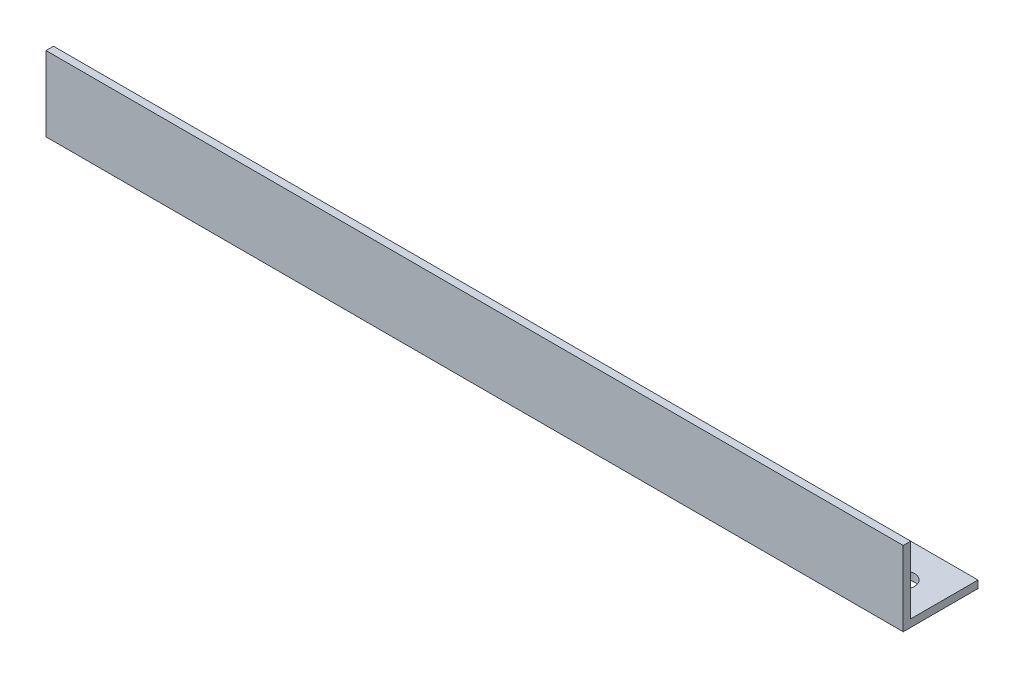
ISO-10303-21;
HEADER;
FILE_DESCRIPTION(('STEP AP214'),'2;1');
FILE_NAME('part.step','',(''),(''),'','','');
FILE_SCHEMA(('AUTOMOTIVE_DESIGN { 1 0 10303 214 1 1 1 1 }'));
ENDSEC;
DATA;
#1=APPLICATION_CONTEXT('core data for automotive mechanical design processes');
#2=APPLICATION_PROTOCOL_DEFINITION('international standard','automotive_design',2000,#1);
#3=PRODUCT_CONTEXT('',#1,'mechanical');
#4=PRODUCT('Part','Part','',(#3));
#5=PRODUCT_RELATED_PRODUCT_CATEGORY('part','',(#4));
#6=PRODUCT_DEFINITION_FORMATION('','',#4);
#7=PRODUCT_DEFINITION_CONTEXT('part definition',#1,'design');
#8=PRODUCT_DEFINITION('design','',#6,#7);
#9=PRODUCT_DEFINITION_SHAPE('','',#8);
#10=(LENGTH_UNIT() NAMED_UNIT(*) SI_UNIT(.MILLI.,.METRE.));
#11=(NAMED_UNIT(*) PLANE_ANGLE_UNIT() SI_UNIT($,.RADIAN.));
#12=(NAMED_UNIT(*) SI_UNIT($,.STERADIAN.) SOLID_ANGLE_UNIT());
#13=UNCERTAINTY_MEASURE_WITH_UNIT(LENGTH_MEASURE(1.E-05),#10,'distance_accuracy_value','');
#14=(GEOMETRIC_REPRESENTATION_CONTEXT(3) GLOBAL_UNCERTAINTY_ASSIGNED_CONTEXT((#13)) GLOBAL_UNIT_ASSIGNED_CONTEXT((#10,
#11,#12)) REPRESENTATION_CONTEXT('',''));
#15=CARTESIAN_POINT('',(0.,0.,0.));
#16=DIRECTION('',(0.,0.,1.));
#17=DIRECTION('',(1.,0.,0.));
#18=AXIS2_PLACEMENT_3D('',#15,#16,#17);
#19=CARTESIAN_POINT('',(172.,0.,-15.));
#20=DIRECTION('',(0.,1.,0.));
#21=DIRECTION('',(0.,0.,1.));
#22=AXIS2_PLACEMENT_3D('',#19,#20,#21);
#23=PLANE('',#22);
#24=CARTESIAN_POINT('',(7.5,0.,-7.49999999999999));
#25=DIRECTION('',(0.,-1.,0.));
#26=DIRECTION('',(0.,0.,-1.));
#27=AXIS2_PLACEMENT_3D('',#24,#25,#26);
#28=CIRCLE('',#27,2.25);
#29=CARTESIAN_POINT('',(7.5,0.,-9.74999999999999));
#30=VERTEX_POINT('',#29);
#31=EDGE_CURVE('E140',#30,#30,#28,.T.);
#32=ORIENTED_EDGE('',*,*,#31,.F.);
#33=EDGE_LOOP('',(#32));
#34=FACE_BOUND('',#33,.T.);
#35=CARTESIAN_POINT('',(164.5,0.,-7.49999999999999));
#36=DIRECTION('',(0.,-1.,0.));
#37=DIRECTION('',(0.,0.,-1.));
#38=AXIS2_PLACEMENT_3D('',#35,#36,#37);
#39=CIRCLE('',#38,2.25000000000001);
#40=CARTESIAN_POINT('',(164.5,0.,-9.75));
#41=VERTEX_POINT('',#40);
#42=EDGE_CURVE('E145',#41,#41,#39,.T.);
#43=ORIENTED_EDGE('',*,*,#42,.F.);
#44=EDGE_LOOP('',(#43));
#45=FACE_BOUND('',#44,.T.);
#46=DIRECTION('',(0.,0.,-1.));
#47=VECTOR('',#46,1.);
#48=CARTESIAN_POINT('',(0.,0.,-15.));
#49=LINE('',#48,#47);
#50=CARTESIAN_POINT('',(0.,0.,0.));
#51=VERTEX_POINT('',#50);
#52=CARTESIAN_POINT('',(0.,0.,-15.));
#53=VERTEX_POINT('',#52);
#54=EDGE_CURVE('E123',#51,#53,#49,.T.);
#55=ORIENTED_EDGE('',*,*,#54,.T.);
#56=DIRECTION('',(-1.,0.,0.));
#57=VECTOR('',#56,1.);
#58=CARTESIAN_POINT('',(172.,0.,-15.));
#59=LINE('',#58,#57);
#60=CARTESIAN_POINT('',(172.,0.,-15.));
#61=VERTEX_POINT('',#60);
#62=EDGE_CURVE('E11',#61,#53,#59,.T.);
#63=ORIENTED_EDGE('',*,*,#62,.F.);
#64=DIRECTION('',(0.,0.,-1.));
#65=VECTOR('',#64,1.);
#66=CARTESIAN_POINT('',(172.,0.,-15.));
#67=LINE('',#66,#65);
#68=CARTESIAN_POINT('',(172.,0.,0.));
#69=VERTEX_POINT('',#68);
#70=EDGE_CURVE('E133',#69,#61,#67,.T.);
#71=ORIENTED_EDGE('',*,*,#70,.F.);
#72=DIRECTION('',(-1.,0.,0.));
#73=VECTOR('',#72,1.);
#74=CARTESIAN_POINT('',(172.,0.,0.));
#75=LINE('',#74,#73);
#76=EDGE_CURVE('E119',#69,#51,#75,.T.);
#77=ORIENTED_EDGE('',*,*,#76,.T.);
#78=EDGE_LOOP('',(#55,#63,#71,#77));
#79=FACE_BOUND('',#78,.T.);
#80=ADVANCED_FACE('F37',(#34,#45,#79),#23,.F.);
#81=CARTESIAN_POINT('',(172.,1.49999999999998,-15.));
#82=DIRECTION('',(0.,0.,1.));
#83=DIRECTION('',(1.,0.,0.));
#84=AXIS2_PLACEMENT_3D('',#81,#82,#83);
#85=PLANE('',#84);
#86=DIRECTION('',(0.,1.,0.));
#87=VECTOR('',#86,1.);
#88=CARTESIAN_POINT('',(0.,1.49999999999998,-15.));
#89=LINE('',#88,#87);
#90=CARTESIAN_POINT('',(0.,1.49999999999998,-15.));
#91=VERTEX_POINT('',#90);
#92=EDGE_CURVE('E126',#53,#91,#89,.T.);
#93=ORIENTED_EDGE('',*,*,#92,.T.);
#94=DIRECTION('',(-1.,0.,0.));
#95=VECTOR('',#94,1.);
#96=CARTESIAN_POINT('',(172.,1.49999999999998,-15.));
#97=LINE('',#96,#95);
#98=CARTESIAN_POINT('',(172.,1.49999999999998,-15.));
#99=VERTEX_POINT('',#98);
#100=EDGE_CURVE('E46',#99,#91,#97,.T.);
#101=ORIENTED_EDGE('',*,*,#100,.F.);
#102=DIRECTION('',(0.,1.,0.));
#103=VECTOR('',#102,1.);
#104=CARTESIAN_POINT('',(172.,1.49999999999998,-15.));
#105=LINE('',#104,#103);
#106=EDGE_CURVE('E92',#61,#99,#105,.T.);
#107=ORIENTED_EDGE('',*,*,#106,.F.);
#108=ORIENTED_EDGE('',*,*,#62,.T.);
#109=EDGE_LOOP('',(#93,#101,#107,#108));
#110=FACE_BOUND('',#109,.T.);
#111=ADVANCED_FACE('F155',(#110),#85,.F.);
#112=CARTESIAN_POINT('',(172.,1.5,-1.50000000000002));
#113=DIRECTION('',(0.,-1.,0.));
#114=DIRECTION('',(0.,0.,-1.));
#115=AXIS2_PLACEMENT_3D('',#112,#113,#114);
#116=PLANE('',#115);
#117=CARTESIAN_POINT('',(7.5,1.49999999999999,-7.49999999999999));
#118=DIRECTION('',(0.,-1.,0.));
#119=DIRECTION('',(0.,0.,-1.));
#120=AXIS2_PLACEMENT_3D('',#117,#118,#119);
#121=CIRCLE('',#120,2.25);
#122=CARTESIAN_POINT('',(7.5,1.49999999999999,-9.74999999999999));
#123=VERTEX_POINT('',#122);
#124=EDGE_CURVE('E40',#123,#123,#121,.T.);
#125=ORIENTED_EDGE('',*,*,#124,.T.);
#126=EDGE_LOOP('',(#125));
#127=FACE_BOUND('',#126,.T.);
#128=CARTESIAN_POINT('',(164.5,1.49999999999999,-7.49999999999999));
#129=DIRECTION('',(0.,-1.,0.));
#130=DIRECTION('',(0.,0.,-1.));
#131=AXIS2_PLACEMENT_3D('',#128,#129,#130);
#132=CIRCLE('',#131,2.25000000000001);
#133=CARTESIAN_POINT('',(164.5,1.49999999999999,-9.75));
#134=VERTEX_POINT('',#133);
#135=EDGE_CURVE('E138',#134,#134,#132,.T.);
#136=ORIENTED_EDGE('',*,*,#135,.T.);
#137=EDGE_LOOP('',(#136));
#138=FACE_BOUND('',#137,.T.);
#139=DIRECTION('',(0.,0.,1.));
#140=VECTOR('',#139,1.);
#141=CARTESIAN_POINT('',(0.,1.5,-1.50000000000002));
#142=LINE('',#141,#140);
#143=CARTESIAN_POINT('',(0.,1.5,-1.50000000000002));
#144=VERTEX_POINT('',#143);
#145=EDGE_CURVE('E128',#91,#144,#142,.T.);
#146=ORIENTED_EDGE('',*,*,#145,.T.);
#147=DIRECTION('',(-1.,0.,0.));
#148=VECTOR('',#147,1.);
#149=CARTESIAN_POINT('',(172.,1.5,-1.50000000000002));
#150=LINE('',#149,#148);
#151=CARTESIAN_POINT('',(172.,1.5,-1.50000000000002));
#152=VERTEX_POINT('',#151);
#153=EDGE_CURVE('E114',#152,#144,#150,.T.);
#154=ORIENTED_EDGE('',*,*,#153,.F.);
#155=DIRECTION('',(0.,0.,1.));
#156=VECTOR('',#155,1.);
#157=CARTESIAN_POINT('',(172.,1.5,-1.50000000000002));
#158=LINE('',#157,#156);
#159=EDGE_CURVE('E105',#99,#152,#158,.T.);
#160=ORIENTED_EDGE('',*,*,#159,.F.);
#161=ORIENTED_EDGE('',*,*,#100,.T.);
#162=EDGE_LOOP('',(#146,#154,#160,#161));
#163=FACE_BOUND('',#162,.T.);
#164=ADVANCED_FACE('F158',(#127,#138,#163),#116,.F.);
#165=CARTESIAN_POINT('',(172.,15.,-1.5));
#166=DIRECTION('',(0.,0.,1.));
#167=DIRECTION('',(0.,-1.,0.));
#168=AXIS2_PLACEMENT_3D('',#165,#166,#167);
#169=PLANE('',#168);
#170=DIRECTION('',(0.,1.,0.));
#171=VECTOR('',#170,1.);
#172=CARTESIAN_POINT('',(0.,15.,-1.5));
#173=LINE('',#172,#171);
#174=CARTESIAN_POINT('',(0.,15.,-1.5));
#175=VERTEX_POINT('',#174);
#176=EDGE_CURVE('E113',#144,#175,#173,.T.);
#177=ORIENTED_EDGE('',*,*,#176,.T.);
#178=DIRECTION('',(-1.,0.,0.));
#179=VECTOR('',#178,1.);
#180=CARTESIAN_POINT('',(172.,15.,-1.5));
#181=LINE('',#180,#179);
#182=CARTESIAN_POINT('',(172.,15.,-1.5));
#183=VERTEX_POINT('',#182);
#184=EDGE_CURVE('E110',#183,#175,#181,.T.);
#185=ORIENTED_EDGE('',*,*,#184,.F.);
#186=DIRECTION('',(0.,1.,0.));
#187=VECTOR('',#186,1.);
#188=CARTESIAN_POINT('',(172.,15.,-1.5));
#189=LINE('',#188,#187);
#190=EDGE_CURVE('E99',#152,#183,#189,.T.);
#191=ORIENTED_EDGE('',*,*,#190,.F.);
#192=ORIENTED_EDGE('',*,*,#153,.T.);
#193=EDGE_LOOP('',(#177,#185,#191,#192));
#194=FACE_BOUND('',#193,.T.);
#195=ADVANCED_FACE('F111',(#194),#169,.F.);
#196=CARTESIAN_POINT('',(172.,15.,0.));
#197=DIRECTION('',(0.,-1.,0.));
#198=DIRECTION('',(0.,0.,-1.));
#199=AXIS2_PLACEMENT_3D('',#196,#197,#198);
#200=PLANE('',#199);
#201=DIRECTION('',(0.,0.,1.));
#202=VECTOR('',#201,1.);
#203=CARTESIAN_POINT('',(0.,15.,0.));
#204=LINE('',#203,#202);
#205=CARTESIAN_POINT('',(0.,15.,0.));
#206=VERTEX_POINT('',#205);
#207=EDGE_CURVE('E78',#175,#206,#204,.T.);
#208=ORIENTED_EDGE('',*,*,#207,.T.);
#209=DIRECTION('',(-1.,0.,0.));
#210=VECTOR('',#209,1.);
#211=CARTESIAN_POINT('',(172.,15.,0.));
#212=LINE('',#211,#210);
#213=CARTESIAN_POINT('',(172.,15.,0.));
#214=VERTEX_POINT('',#213);
#215=EDGE_CURVE('E115',#214,#206,#212,.T.);
#216=ORIENTED_EDGE('',*,*,#215,.F.);
#217=DIRECTION('',(0.,0.,1.));
#218=VECTOR('',#217,1.);
#219=CARTESIAN_POINT('',(172.,15.,0.));
#220=LINE('',#219,#218);
#221=EDGE_CURVE('E103',#183,#214,#220,.T.);
#222=ORIENTED_EDGE('',*,*,#221,.F.);
#223=ORIENTED_EDGE('',*,*,#184,.T.);
#224=EDGE_LOOP('',(#208,#216,#222,#223));
#225=FACE_BOUND('',#224,.T.);
#226=ADVANCED_FACE('F117',(#225),#200,.F.);
#227=CARTESIAN_POINT('',(172.,0.,0.));
#228=DIRECTION('',(0.,0.,-1.));
#229=DIRECTION('',(-1.,0.,0.));
#230=AXIS2_PLACEMENT_3D('',#227,#228,#229);
#231=PLANE('',#230);
#232=DIRECTION('',(0.,-1.,0.));
#233=VECTOR('',#232,1.);
#234=CARTESIAN_POINT('',(0.,0.,0.));
#235=LINE('',#234,#233);
#236=EDGE_CURVE('E84',#206,#51,#235,.T.);
#237=ORIENTED_EDGE('',*,*,#236,.T.);
#238=ORIENTED_EDGE('',*,*,#76,.F.);
#239=DIRECTION('',(0.,-1.,0.));
#240=VECTOR('',#239,1.);
#241=CARTESIAN_POINT('',(172.,0.,0.));
#242=LINE('',#241,#240);
#243=EDGE_CURVE('E55',#214,#69,#242,.T.);
#244=ORIENTED_EDGE('',*,*,#243,.F.);
#245=ORIENTED_EDGE('',*,*,#215,.T.);
#246=EDGE_LOOP('',(#237,#238,#244,#245));
#247=FACE_BOUND('',#246,.T.);
#248=ADVANCED_FACE('F163',(#247),#231,.F.);
#249=CARTESIAN_POINT('',(172.,0.,0.));
#250=DIRECTION('',(-1.,0.,0.));
#251=DIRECTION('',(0.,0.,1.));
#252=AXIS2_PLACEMENT_3D('',#249,#250,#251);
#253=PLANE('',#252);
#254=ORIENTED_EDGE('',*,*,#70,.T.);
#255=ORIENTED_EDGE('',*,*,#106,.T.);
#256=ORIENTED_EDGE('',*,*,#159,.T.);
#257=ORIENTED_EDGE('',*,*,#190,.T.);
#258=ORIENTED_EDGE('',*,*,#221,.T.);
#259=ORIENTED_EDGE('',*,*,#243,.T.);
#260=EDGE_LOOP('',(#254,#255,#256,#257,#258,#259));
#261=FACE_BOUND('',#260,.T.);
#262=ADVANCED_FACE('F101',(#261),#253,.F.);
#263=CARTESIAN_POINT('',(0.,0.,0.));
#264=DIRECTION('',(-1.,0.,0.));
#265=DIRECTION('',(0.,0.,1.));
#266=AXIS2_PLACEMENT_3D('',#263,#264,#265);
#267=PLANE('',#266);
#268=ORIENTED_EDGE('',*,*,#54,.F.);
#269=ORIENTED_EDGE('',*,*,#236,.F.);
#270=ORIENTED_EDGE('',*,*,#207,.F.);
#271=ORIENTED_EDGE('',*,*,#176,.F.);
#272=ORIENTED_EDGE('',*,*,#145,.F.);
#273=ORIENTED_EDGE('',*,*,#92,.F.);
#274=EDGE_LOOP('',(#268,#269,#270,#271,#272,#273));
#275=FACE_BOUND('',#274,.T.);
#276=ADVANCED_FACE('F161',(#275),#267,.T.);
#277=CARTESIAN_POINT('',(164.5,15.,-7.50000000000001));
#278=DIRECTION('',(0.,-1.,0.));
#279=DIRECTION('',(0.,0.,-1.));
#280=AXIS2_PLACEMENT_3D('',#277,#278,#279);
#281=CYLINDRICAL_SURFACE('',#280,2.25000000000001);
#282=ORIENTED_EDGE('',*,*,#42,.T.);
#283=EDGE_LOOP('',(#282));
#284=FACE_BOUND('',#283,.T.);
#285=ORIENTED_EDGE('',*,*,#135,.F.);
#286=EDGE_LOOP('',(#285));
#287=FACE_BOUND('',#286,.T.);
#288=ADVANCED_FACE('F181',(#284,#287),#281,.F.);
#289=CARTESIAN_POINT('',(7.5,15.,-7.50000000000001));
#290=DIRECTION('',(0.,-1.,0.));
#291=DIRECTION('',(0.,0.,-1.));
#292=AXIS2_PLACEMENT_3D('',#289,#290,#291);
#293=CYLINDRICAL_SURFACE('',#292,2.25);
#294=ORIENTED_EDGE('',*,*,#31,.T.);
#295=EDGE_LOOP('',(#294));
#296=FACE_BOUND('',#295,.T.);
#297=ORIENTED_EDGE('',*,*,#124,.F.);
#298=EDGE_LOOP('',(#297));
#299=FACE_BOUND('',#298,.T.);
#300=ADVANCED_FACE('F184',(#296,#299),#293,.F.);
#301=CLOSED_SHELL('',(#80,#111,#164,#195,#226,#248,#262,#276,#288,#300));
#302=MANIFOLD_SOLID_BREP('B2',#301);
#303=ADVANCED_BREP_SHAPE_REPRESENTATION('',(#18,#302),#14);
#304=SHAPE_DEFINITION_REPRESENTATION(#9,#303);
ENDSEC;
END-ISO-10303-21;
